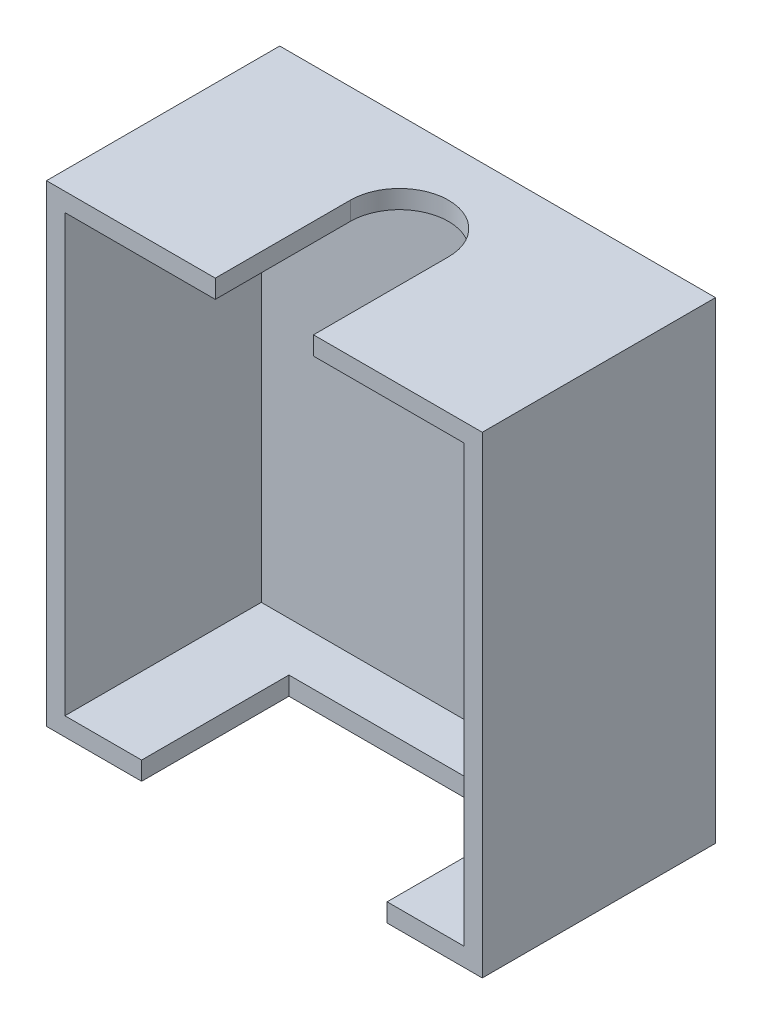
ISO-10303-21;
HEADER;
FILE_DESCRIPTION(('STEP AP214'),'2;1');
FILE_NAME('part.step','',(''),(''),'','','');
FILE_SCHEMA(('AUTOMOTIVE_DESIGN { 1 0 10303 214 1 1 1 1 }'));
ENDSEC;
DATA;
#1=APPLICATION_CONTEXT('core data for automotive mechanical design processes');
#2=APPLICATION_PROTOCOL_DEFINITION('international standard','automotive_design',2000,#1);
#3=PRODUCT_CONTEXT('',#1,'mechanical');
#4=PRODUCT('Part','Part','',(#3));
#5=PRODUCT_RELATED_PRODUCT_CATEGORY('part','',(#4));
#6=PRODUCT_DEFINITION_FORMATION('','',#4);
#7=PRODUCT_DEFINITION_CONTEXT('part definition',#1,'design');
#8=PRODUCT_DEFINITION('design','',#6,#7);
#9=PRODUCT_DEFINITION_SHAPE('','',#8);
#10=(LENGTH_UNIT() NAMED_UNIT(*) SI_UNIT(.MILLI.,.METRE.));
#11=(NAMED_UNIT(*) PLANE_ANGLE_UNIT() SI_UNIT($,.RADIAN.));
#12=(NAMED_UNIT(*) SI_UNIT($,.STERADIAN.) SOLID_ANGLE_UNIT());
#13=UNCERTAINTY_MEASURE_WITH_UNIT(LENGTH_MEASURE(1.E-05),#10,'distance_accuracy_value','');
#14=(GEOMETRIC_REPRESENTATION_CONTEXT(3) GLOBAL_UNCERTAINTY_ASSIGNED_CONTEXT((#13)) GLOBAL_UNIT_ASSIGNED_CONTEXT((#10,
#11,#12)) REPRESENTATION_CONTEXT('',''));
#15=CARTESIAN_POINT('',(0.,0.,0.));
#16=DIRECTION('',(0.,0.,1.));
#17=DIRECTION('',(1.,0.,0.));
#18=AXIS2_PLACEMENT_3D('',#15,#16,#17);
#19=CARTESIAN_POINT('',(0.,0.,19.));
#20=DIRECTION('',(0.,0.,-1.));
#21=DIRECTION('',(-1.,0.,0.));
#22=AXIS2_PLACEMENT_3D('',#19,#20,#21);
#23=PLANE('',#22);
#24=DIRECTION('',(1.,0.,0.));
#25=VECTOR('',#24,1.);
#26=CARTESIAN_POINT('',(17.75,-19.25,19.));
#27=LINE('',#26,#25);
#28=CARTESIAN_POINT('',(-17.75,-19.25,19.));
#29=VERTEX_POINT('',#28);
#30=CARTESIAN_POINT('',(-10.,-19.25,19.));
#31=VERTEX_POINT('',#30);
#32=EDGE_CURVE('E229',#29,#31,#27,.T.);
#33=ORIENTED_EDGE('',*,*,#32,.T.);
#34=DIRECTION('',(0.,-1.,0.));
#35=VECTOR('',#34,1.);
#36=CARTESIAN_POINT('',(-10.,-14.25,19.));
#37=LINE('',#36,#35);
#38=CARTESIAN_POINT('',(-10.,-17.75,19.));
#39=VERTEX_POINT('',#38);
#40=EDGE_CURVE('E158',#39,#31,#37,.T.);
#41=ORIENTED_EDGE('',*,*,#40,.F.);
#42=DIRECTION('',(1.,0.,0.));
#43=VECTOR('',#42,1.);
#44=CARTESIAN_POINT('',(16.25,-17.75,19.));
#45=LINE('',#44,#43);
#46=CARTESIAN_POINT('',(-16.25,-17.75,19.));
#47=VERTEX_POINT('',#46);
#48=EDGE_CURVE('E204',#47,#39,#45,.T.);
#49=ORIENTED_EDGE('',*,*,#48,.F.);
#50=DIRECTION('',(0.,-1.,0.));
#51=VECTOR('',#50,1.);
#52=CARTESIAN_POINT('',(-16.25,17.75,19.));
#53=LINE('',#52,#51);
#54=CARTESIAN_POINT('',(-16.25,17.75,19.));
#55=VERTEX_POINT('',#54);
#56=EDGE_CURVE('E182',#55,#47,#53,.T.);
#57=ORIENTED_EDGE('',*,*,#56,.F.);
#58=DIRECTION('',(-1.,0.,0.));
#59=VECTOR('',#58,1.);
#60=CARTESIAN_POINT('',(16.25,17.75,19.));
#61=LINE('',#60,#59);
#62=CARTESIAN_POINT('',(-4.,17.75,19.));
#63=VERTEX_POINT('',#62);
#64=EDGE_CURVE('E210',#63,#55,#61,.T.);
#65=ORIENTED_EDGE('',*,*,#64,.F.);
#66=DIRECTION('',(0.,1.,0.));
#67=VECTOR('',#66,1.);
#68=CARTESIAN_POINT('',(-4.,14.25,19.));
#69=LINE('',#68,#67);
#70=CARTESIAN_POINT('',(-4.,19.25,19.));
#71=VERTEX_POINT('',#70);
#72=EDGE_CURVE('E183',#63,#71,#69,.T.);
#73=ORIENTED_EDGE('',*,*,#72,.T.);
#74=DIRECTION('',(-1.,0.,0.));
#75=VECTOR('',#74,1.);
#76=CARTESIAN_POINT('',(17.75,19.25,19.));
#77=LINE('',#76,#75);
#78=CARTESIAN_POINT('',(-17.75,19.25,19.));
#79=VERTEX_POINT('',#78);
#80=EDGE_CURVE('E233',#71,#79,#77,.T.);
#81=ORIENTED_EDGE('',*,*,#80,.T.);
#82=DIRECTION('',(0.,-1.,0.));
#83=VECTOR('',#82,1.);
#84=CARTESIAN_POINT('',(-17.75,19.25,19.));
#85=LINE('',#84,#83);
#86=EDGE_CURVE('E224',#79,#29,#85,.T.);
#87=ORIENTED_EDGE('',*,*,#86,.T.);
#88=EDGE_LOOP('',(#33,#41,#49,#57,#65,#73,#81,#87));
#89=FACE_BOUND('',#88,.T.);
#90=ADVANCED_FACE('F32',(#89),#23,.F.);
#91=CARTESIAN_POINT('',(-17.75,19.25,19.));
#92=DIRECTION('',(1.,0.,0.));
#93=DIRECTION('',(0.,0.,-1.));
#94=AXIS2_PLACEMENT_3D('',#91,#92,#93);
#95=PLANE('',#94);
#96=DIRECTION('',(0.,-1.,0.));
#97=VECTOR('',#96,1.);
#98=CARTESIAN_POINT('',(-17.75,19.25,0.));
#99=LINE('',#98,#97);
#100=CARTESIAN_POINT('',(-17.75,19.25,0.));
#101=VERTEX_POINT('',#100);
#102=CARTESIAN_POINT('',(-17.75,-19.25,0.));
#103=VERTEX_POINT('',#102);
#104=EDGE_CURVE('E216',#101,#103,#99,.T.);
#105=ORIENTED_EDGE('',*,*,#104,.T.);
#106=DIRECTION('',(0.,0.,-1.));
#107=VECTOR('',#106,1.);
#108=CARTESIAN_POINT('',(-17.75,-19.25,19.));
#109=LINE('',#108,#107);
#110=EDGE_CURVE('E253',#29,#103,#109,.T.);
#111=ORIENTED_EDGE('',*,*,#110,.F.);
#112=ORIENTED_EDGE('',*,*,#86,.F.);
#113=DIRECTION('',(0.,0.,-1.));
#114=VECTOR('',#113,1.);
#115=CARTESIAN_POINT('',(-17.75,19.25,19.));
#116=LINE('',#115,#114);
#117=EDGE_CURVE('E237',#79,#101,#116,.T.);
#118=ORIENTED_EDGE('',*,*,#117,.T.);
#119=EDGE_LOOP('',(#105,#111,#112,#118));
#120=FACE_BOUND('',#119,.T.);
#121=ADVANCED_FACE('F34',(#120),#95,.F.);
#122=CARTESIAN_POINT('',(17.75,-19.25,19.));
#123=DIRECTION('',(0.,1.,0.));
#124=DIRECTION('',(-1.,0.,0.));
#125=AXIS2_PLACEMENT_3D('',#122,#123,#124);
#126=PLANE('',#125);
#127=DIRECTION('',(1.,0.,0.));
#128=VECTOR('',#127,1.);
#129=CARTESIAN_POINT('',(-10.,-19.25,7.));
#130=LINE('',#129,#128);
#131=CARTESIAN_POINT('',(-10.,-19.25,7.));
#132=VERTEX_POINT('',#131);
#133=CARTESIAN_POINT('',(10.,-19.25,7.));
#134=VERTEX_POINT('',#133);
#135=EDGE_CURVE('E147',#132,#134,#130,.T.);
#136=ORIENTED_EDGE('',*,*,#135,.F.);
#137=DIRECTION('',(0.,0.,-1.));
#138=VECTOR('',#137,1.);
#139=CARTESIAN_POINT('',(-10.,-19.25,19.));
#140=LINE('',#139,#138);
#141=EDGE_CURVE('E155',#31,#132,#140,.T.);
#142=ORIENTED_EDGE('',*,*,#141,.F.);
#143=ORIENTED_EDGE('',*,*,#32,.F.);
#144=ORIENTED_EDGE('',*,*,#110,.T.);
#145=DIRECTION('',(1.,0.,0.));
#146=VECTOR('',#145,1.);
#147=CARTESIAN_POINT('',(17.75,-19.25,0.));
#148=LINE('',#147,#146);
#149=CARTESIAN_POINT('',(17.75,-19.25,0.));
#150=VERTEX_POINT('',#149);
#151=EDGE_CURVE('E240',#103,#150,#148,.T.);
#152=ORIENTED_EDGE('',*,*,#151,.T.);
#153=DIRECTION('',(0.,0.,-1.));
#154=VECTOR('',#153,1.);
#155=CARTESIAN_POINT('',(17.75,-19.25,19.));
#156=LINE('',#155,#154);
#157=CARTESIAN_POINT('',(17.75,-19.25,19.));
#158=VERTEX_POINT('',#157);
#159=EDGE_CURVE('E250',#158,#150,#156,.T.);
#160=ORIENTED_EDGE('',*,*,#159,.F.);
#161=CARTESIAN_POINT('',(10.,-19.25,19.));
#162=VERTEX_POINT('',#161);
#163=EDGE_CURVE('E227',#162,#158,#27,.T.);
#164=ORIENTED_EDGE('',*,*,#163,.F.);
#165=DIRECTION('',(0.,0.,1.));
#166=VECTOR('',#165,1.);
#167=CARTESIAN_POINT('',(10.,-19.25,19.));
#168=LINE('',#167,#166);
#169=EDGE_CURVE('E152',#134,#162,#168,.T.);
#170=ORIENTED_EDGE('',*,*,#169,.F.);
#171=EDGE_LOOP('',(#136,#142,#143,#144,#152,#160,#164,#170));
#172=FACE_BOUND('',#171,.T.);
#173=ADVANCED_FACE('F162',(#172),#126,.F.);
#174=CARTESIAN_POINT('',(17.75,19.25,19.));
#175=DIRECTION('',(-1.,0.,0.));
#176=DIRECTION('',(0.,-1.,0.));
#177=AXIS2_PLACEMENT_3D('',#174,#175,#176);
#178=PLANE('',#177);
#179=DIRECTION('',(0.,1.,0.));
#180=VECTOR('',#179,1.);
#181=CARTESIAN_POINT('',(17.75,19.25,0.));
#182=LINE('',#181,#180);
#183=CARTESIAN_POINT('',(17.75,19.25,0.));
#184=VERTEX_POINT('',#183);
#185=EDGE_CURVE('E242',#150,#184,#182,.T.);
#186=ORIENTED_EDGE('',*,*,#185,.T.);
#187=DIRECTION('',(0.,0.,-1.));
#188=VECTOR('',#187,1.);
#189=CARTESIAN_POINT('',(17.75,19.25,19.));
#190=LINE('',#189,#188);
#191=CARTESIAN_POINT('',(17.75,19.25,19.));
#192=VERTEX_POINT('',#191);
#193=EDGE_CURVE('E247',#192,#184,#190,.T.);
#194=ORIENTED_EDGE('',*,*,#193,.F.);
#195=DIRECTION('',(0.,1.,0.));
#196=VECTOR('',#195,1.);
#197=CARTESIAN_POINT('',(17.75,19.25,19.));
#198=LINE('',#197,#196);
#199=EDGE_CURVE('E231',#158,#192,#198,.T.);
#200=ORIENTED_EDGE('',*,*,#199,.F.);
#201=ORIENTED_EDGE('',*,*,#159,.T.);
#202=EDGE_LOOP('',(#186,#194,#200,#201));
#203=FACE_BOUND('',#202,.T.);
#204=ADVANCED_FACE('F301',(#203),#178,.F.);
#205=CARTESIAN_POINT('',(17.75,19.25,19.));
#206=DIRECTION('',(0.,-1.,0.));
#207=DIRECTION('',(1.,0.,0.));
#208=AXIS2_PLACEMENT_3D('',#205,#206,#207);
#209=PLANE('',#208);
#210=CARTESIAN_POINT('',(0.,19.25,8.));
#211=DIRECTION('',(0.,1.,0.));
#212=DIRECTION('',(-1.,0.,0.));
#213=AXIS2_PLACEMENT_3D('',#210,#211,#212);
#214=CIRCLE('',#213,4.);
#215=CARTESIAN_POINT('',(4.,19.25,8.));
#216=VERTEX_POINT('',#215);
#217=CARTESIAN_POINT('',(-4.,19.25,8.));
#218=VERTEX_POINT('',#217);
#219=EDGE_CURVE('E175',#216,#218,#214,.T.);
#220=ORIENTED_EDGE('',*,*,#219,.F.);
#221=DIRECTION('',(0.,0.,-1.));
#222=VECTOR('',#221,1.);
#223=CARTESIAN_POINT('',(4.,19.25,0.));
#224=LINE('',#223,#222);
#225=CARTESIAN_POINT('',(4.,19.25,19.));
#226=VERTEX_POINT('',#225);
#227=EDGE_CURVE('E168',#226,#216,#224,.T.);
#228=ORIENTED_EDGE('',*,*,#227,.F.);
#229=EDGE_CURVE('E234',#192,#226,#77,.T.);
#230=ORIENTED_EDGE('',*,*,#229,.F.);
#231=ORIENTED_EDGE('',*,*,#193,.T.);
#232=DIRECTION('',(-1.,0.,0.));
#233=VECTOR('',#232,1.);
#234=CARTESIAN_POINT('',(17.75,19.25,0.));
#235=LINE('',#234,#233);
#236=EDGE_CURVE('E228',#184,#101,#235,.T.);
#237=ORIENTED_EDGE('',*,*,#236,.T.);
#238=ORIENTED_EDGE('',*,*,#117,.F.);
#239=ORIENTED_EDGE('',*,*,#80,.F.);
#240=DIRECTION('',(0.,0.,1.));
#241=VECTOR('',#240,1.);
#242=CARTESIAN_POINT('',(-4.,19.25,0.));
#243=LINE('',#242,#241);
#244=EDGE_CURVE('E177',#218,#71,#243,.T.);
#245=ORIENTED_EDGE('',*,*,#244,.F.);
#246=EDGE_LOOP('',(#220,#228,#230,#231,#237,#238,#239,#245));
#247=FACE_BOUND('',#246,.T.);
#248=ADVANCED_FACE('F306',(#247),#209,.F.);
#249=CARTESIAN_POINT('',(10.,-17.75,19.));
#250=VERTEX_POINT('',#249);
#251=CARTESIAN_POINT('',(16.25,-17.75,19.));
#252=VERTEX_POINT('',#251);
#253=EDGE_CURVE('E203',#250,#252,#45,.T.);
#254=ORIENTED_EDGE('',*,*,#253,.F.);
#255=DIRECTION('',(0.,-1.,0.));
#256=VECTOR('',#255,1.);
#257=CARTESIAN_POINT('',(10.,-14.25,19.));
#258=LINE('',#257,#256);
#259=EDGE_CURVE('E169',#250,#162,#258,.T.);
#260=ORIENTED_EDGE('',*,*,#259,.T.);
#261=ORIENTED_EDGE('',*,*,#163,.T.);
#262=ORIENTED_EDGE('',*,*,#199,.T.);
#263=ORIENTED_EDGE('',*,*,#229,.T.);
#264=DIRECTION('',(0.,1.,0.));
#265=VECTOR('',#264,1.);
#266=CARTESIAN_POINT('',(4.,14.25,19.));
#267=LINE('',#266,#265);
#268=CARTESIAN_POINT('',(4.,17.75,19.));
#269=VERTEX_POINT('',#268);
#270=EDGE_CURVE('E180',#269,#226,#267,.T.);
#271=ORIENTED_EDGE('',*,*,#270,.F.);
#272=CARTESIAN_POINT('',(16.25,17.75,19.));
#273=VERTEX_POINT('',#272);
#274=EDGE_CURVE('E192',#273,#269,#61,.T.);
#275=ORIENTED_EDGE('',*,*,#274,.F.);
#276=DIRECTION('',(0.,1.,0.));
#277=VECTOR('',#276,1.);
#278=CARTESIAN_POINT('',(16.25,17.75,19.));
#279=LINE('',#278,#277);
#280=EDGE_CURVE('E207',#252,#273,#279,.T.);
#281=ORIENTED_EDGE('',*,*,#280,.F.);
#282=EDGE_LOOP('',(#254,#260,#261,#262,#263,#271,#275,#281));
#283=FACE_BOUND('',#282,.T.);
#284=ADVANCED_FACE('F272',(#283),#23,.F.);
#285=CARTESIAN_POINT('',(0.,0.,0.));
#286=DIRECTION('',(0.,0.,-1.));
#287=DIRECTION('',(-1.,0.,0.));
#288=AXIS2_PLACEMENT_3D('',#285,#286,#287);
#289=PLANE('',#288);
#290=ORIENTED_EDGE('',*,*,#104,.F.);
#291=ORIENTED_EDGE('',*,*,#236,.F.);
#292=ORIENTED_EDGE('',*,*,#185,.F.);
#293=ORIENTED_EDGE('',*,*,#151,.F.);
#294=EDGE_LOOP('',(#290,#291,#292,#293));
#295=FACE_BOUND('',#294,.T.);
#296=ADVANCED_FACE('F297',(#295),#289,.T.);
#297=CARTESIAN_POINT('',(-16.25,17.75,3.));
#298=DIRECTION('',(-1.,0.,0.));
#299=DIRECTION('',(0.,-1.,0.));
#300=AXIS2_PLACEMENT_3D('',#297,#298,#299);
#301=PLANE('',#300);
#302=ORIENTED_EDGE('',*,*,#56,.T.);
#303=DIRECTION('',(0.,0.,1.));
#304=VECTOR('',#303,1.);
#305=CARTESIAN_POINT('',(-16.25,-17.75,3.));
#306=LINE('',#305,#304);
#307=CARTESIAN_POINT('',(-16.25,-17.75,3.));
#308=VERTEX_POINT('',#307);
#309=EDGE_CURVE('E201',#308,#47,#306,.T.);
#310=ORIENTED_EDGE('',*,*,#309,.F.);
#311=DIRECTION('',(0.,-1.,0.));
#312=VECTOR('',#311,1.);
#313=CARTESIAN_POINT('',(-16.25,17.75,3.));
#314=LINE('',#313,#312);
#315=CARTESIAN_POINT('',(-16.25,17.75,3.));
#316=VERTEX_POINT('',#315);
#317=EDGE_CURVE('E188',#316,#308,#314,.T.);
#318=ORIENTED_EDGE('',*,*,#317,.F.);
#319=DIRECTION('',(0.,0.,1.));
#320=VECTOR('',#319,1.);
#321=CARTESIAN_POINT('',(-16.25,17.75,3.));
#322=LINE('',#321,#320);
#323=EDGE_CURVE('E213',#316,#55,#322,.T.);
#324=ORIENTED_EDGE('',*,*,#323,.T.);
#325=EDGE_LOOP('',(#302,#310,#318,#324));
#326=FACE_BOUND('',#325,.T.);
#327=ADVANCED_FACE('F285',(#326),#301,.F.);
#328=CARTESIAN_POINT('',(16.25,17.75,3.));
#329=DIRECTION('',(0.,1.,0.));
#330=DIRECTION('',(-1.,0.,0.));
#331=AXIS2_PLACEMENT_3D('',#328,#329,#330);
#332=PLANE('',#331);
#333=ORIENTED_EDGE('',*,*,#274,.T.);
#334=DIRECTION('',(0.,0.,-1.));
#335=VECTOR('',#334,1.);
#336=CARTESIAN_POINT('',(4.,17.75,3.));
#337=LINE('',#336,#335);
#338=CARTESIAN_POINT('',(4.,17.75,8.));
#339=VERTEX_POINT('',#338);
#340=EDGE_CURVE('E262',#269,#339,#337,.T.);
#341=ORIENTED_EDGE('',*,*,#340,.T.);
#342=CARTESIAN_POINT('',(0.,17.75,8.));
#343=DIRECTION('',(0.,1.,0.));
#344=DIRECTION('',(-1.,0.,0.));
#345=AXIS2_PLACEMENT_3D('',#342,#343,#344);
#346=CIRCLE('',#345,4.);
#347=CARTESIAN_POINT('',(-4.,17.75,8.));
#348=VERTEX_POINT('',#347);
#349=EDGE_CURVE('E256',#339,#348,#346,.T.);
#350=ORIENTED_EDGE('',*,*,#349,.T.);
#351=DIRECTION('',(0.,0.,1.));
#352=VECTOR('',#351,1.);
#353=CARTESIAN_POINT('',(-4.,17.75,3.));
#354=LINE('',#353,#352);
#355=EDGE_CURVE('E259',#348,#63,#354,.T.);
#356=ORIENTED_EDGE('',*,*,#355,.T.);
#357=ORIENTED_EDGE('',*,*,#64,.T.);
#358=ORIENTED_EDGE('',*,*,#323,.F.);
#359=DIRECTION('',(-1.,0.,0.));
#360=VECTOR('',#359,1.);
#361=CARTESIAN_POINT('',(16.25,17.75,3.));
#362=LINE('',#361,#360);
#363=CARTESIAN_POINT('',(16.25,17.75,3.));
#364=VERTEX_POINT('',#363);
#365=EDGE_CURVE('E198',#364,#316,#362,.T.);
#366=ORIENTED_EDGE('',*,*,#365,.F.);
#367=DIRECTION('',(0.,0.,1.));
#368=VECTOR('',#367,1.);
#369=CARTESIAN_POINT('',(16.25,17.75,3.));
#370=LINE('',#369,#368);
#371=EDGE_CURVE('E217',#364,#273,#370,.T.);
#372=ORIENTED_EDGE('',*,*,#371,.T.);
#373=EDGE_LOOP('',(#333,#341,#350,#356,#357,#358,#366,#372));
#374=FACE_BOUND('',#373,.T.);
#375=ADVANCED_FACE('F310',(#374),#332,.F.);
#376=CARTESIAN_POINT('',(16.25,17.75,3.));
#377=DIRECTION('',(1.,0.,0.));
#378=DIRECTION('',(0.,1.,0.));
#379=AXIS2_PLACEMENT_3D('',#376,#377,#378);
#380=PLANE('',#379);
#381=ORIENTED_EDGE('',*,*,#280,.T.);
#382=ORIENTED_EDGE('',*,*,#371,.F.);
#383=DIRECTION('',(0.,1.,0.));
#384=VECTOR('',#383,1.);
#385=CARTESIAN_POINT('',(16.25,17.75,3.));
#386=LINE('',#385,#384);
#387=CARTESIAN_POINT('',(16.25,-17.75,3.));
#388=VERTEX_POINT('',#387);
#389=EDGE_CURVE('E195',#388,#364,#386,.T.);
#390=ORIENTED_EDGE('',*,*,#389,.F.);
#391=DIRECTION('',(0.,0.,1.));
#392=VECTOR('',#391,1.);
#393=CARTESIAN_POINT('',(16.25,-17.75,3.));
#394=LINE('',#393,#392);
#395=EDGE_CURVE('E219',#388,#252,#394,.T.);
#396=ORIENTED_EDGE('',*,*,#395,.T.);
#397=EDGE_LOOP('',(#381,#382,#390,#396));
#398=FACE_BOUND('',#397,.T.);
#399=ADVANCED_FACE('F276',(#398),#380,.F.);
#400=CARTESIAN_POINT('',(16.25,-17.75,3.));
#401=DIRECTION('',(0.,-1.,0.));
#402=DIRECTION('',(0.,0.,-1.));
#403=AXIS2_PLACEMENT_3D('',#400,#401,#402);
#404=PLANE('',#403);
#405=ORIENTED_EDGE('',*,*,#48,.T.);
#406=DIRECTION('',(0.,0.,-1.));
#407=VECTOR('',#406,1.);
#408=CARTESIAN_POINT('',(-9.99999999999999,-17.75,2.99999999999999));
#409=LINE('',#408,#407);
#410=CARTESIAN_POINT('',(-10.,-17.75,7.));
#411=VERTEX_POINT('',#410);
#412=EDGE_CURVE('E11',#39,#411,#409,.T.);
#413=ORIENTED_EDGE('',*,*,#412,.T.);
#414=DIRECTION('',(1.,0.,0.));
#415=VECTOR('',#414,1.);
#416=CARTESIAN_POINT('',(16.25,-17.75,7.));
#417=LINE('',#416,#415);
#418=CARTESIAN_POINT('',(10.,-17.75,7.));
#419=VERTEX_POINT('',#418);
#420=EDGE_CURVE('E150',#411,#419,#417,.T.);
#421=ORIENTED_EDGE('',*,*,#420,.T.);
#422=DIRECTION('',(0.,0.,1.));
#423=VECTOR('',#422,1.);
#424=CARTESIAN_POINT('',(10.,-17.75,3.));
#425=LINE('',#424,#423);
#426=EDGE_CURVE('E40',#419,#250,#425,.T.);
#427=ORIENTED_EDGE('',*,*,#426,.T.);
#428=ORIENTED_EDGE('',*,*,#253,.T.);
#429=ORIENTED_EDGE('',*,*,#395,.F.);
#430=DIRECTION('',(1.,0.,0.));
#431=VECTOR('',#430,1.);
#432=CARTESIAN_POINT('',(16.25,-17.75,3.));
#433=LINE('',#432,#431);
#434=EDGE_CURVE('E191',#308,#388,#433,.T.);
#435=ORIENTED_EDGE('',*,*,#434,.F.);
#436=ORIENTED_EDGE('',*,*,#309,.T.);
#437=EDGE_LOOP('',(#405,#413,#421,#427,#428,#429,#435,#436));
#438=FACE_BOUND('',#437,.T.);
#439=ADVANCED_FACE('F268',(#438),#404,.F.);
#440=CARTESIAN_POINT('',(0.,0.,3.));
#441=DIRECTION('',(0.,0.,-1.));
#442=DIRECTION('',(-1.,0.,0.));
#443=AXIS2_PLACEMENT_3D('',#440,#441,#442);
#444=PLANE('',#443);
#445=ORIENTED_EDGE('',*,*,#317,.T.);
#446=ORIENTED_EDGE('',*,*,#434,.T.);
#447=ORIENTED_EDGE('',*,*,#389,.T.);
#448=ORIENTED_EDGE('',*,*,#365,.T.);
#449=EDGE_LOOP('',(#445,#446,#447,#448));
#450=FACE_BOUND('',#449,.T.);
#451=ADVANCED_FACE('F282',(#450),#444,.F.);
#452=CARTESIAN_POINT('',(4.,14.25,0.));
#453=DIRECTION('',(1.,0.,0.));
#454=DIRECTION('',(0.,1.,0.));
#455=AXIS2_PLACEMENT_3D('',#452,#453,#454);
#456=PLANE('',#455);
#457=ORIENTED_EDGE('',*,*,#270,.T.);
#458=ORIENTED_EDGE('',*,*,#227,.T.);
#459=DIRECTION('',(0.,1.,0.));
#460=VECTOR('',#459,1.);
#461=CARTESIAN_POINT('',(4.,14.25,8.));
#462=LINE('',#461,#460);
#463=EDGE_CURVE('E179',#339,#216,#462,.T.);
#464=ORIENTED_EDGE('',*,*,#463,.F.);
#465=ORIENTED_EDGE('',*,*,#340,.F.);
#466=EDGE_LOOP('',(#457,#458,#464,#465));
#467=FACE_BOUND('',#466,.T.);
#468=ADVANCED_FACE('F317',(#467),#456,.F.);
#469=CARTESIAN_POINT('',(-4.,14.25,0.));
#470=DIRECTION('',(-1.,0.,0.));
#471=DIRECTION('',(0.,0.,1.));
#472=AXIS2_PLACEMENT_3D('',#469,#470,#471);
#473=PLANE('',#472);
#474=DIRECTION('',(0.,1.,0.));
#475=VECTOR('',#474,1.);
#476=CARTESIAN_POINT('',(-4.,14.25,8.));
#477=LINE('',#476,#475);
#478=EDGE_CURVE('E55',#348,#218,#477,.T.);
#479=ORIENTED_EDGE('',*,*,#478,.T.);
#480=ORIENTED_EDGE('',*,*,#244,.T.);
#481=ORIENTED_EDGE('',*,*,#72,.F.);
#482=ORIENTED_EDGE('',*,*,#355,.F.);
#483=EDGE_LOOP('',(#479,#480,#481,#482));
#484=FACE_BOUND('',#483,.T.);
#485=ADVANCED_FACE('F312',(#484),#473,.F.);
#486=CARTESIAN_POINT('',(0.,14.25,8.));
#487=DIRECTION('',(0.,1.,0.));
#488=DIRECTION('',(-1.,0.,0.));
#489=AXIS2_PLACEMENT_3D('',#486,#487,#488);
#490=CYLINDRICAL_SURFACE('',#489,4.);
#491=ORIENTED_EDGE('',*,*,#463,.T.);
#492=ORIENTED_EDGE('',*,*,#219,.T.);
#493=ORIENTED_EDGE('',*,*,#478,.F.);
#494=ORIENTED_EDGE('',*,*,#349,.F.);
#495=EDGE_LOOP('',(#491,#492,#493,#494));
#496=FACE_BOUND('',#495,.T.);
#497=ADVANCED_FACE('F315',(#496),#490,.F.);
#498=CARTESIAN_POINT('',(-10.,-14.25,19.));
#499=DIRECTION('',(-1.,0.,0.));
#500=DIRECTION('',(0.,0.,1.));
#501=AXIS2_PLACEMENT_3D('',#498,#499,#500);
#502=PLANE('',#501);
#503=ORIENTED_EDGE('',*,*,#40,.T.);
#504=ORIENTED_EDGE('',*,*,#141,.T.);
#505=DIRECTION('',(0.,-1.,0.));
#506=VECTOR('',#505,1.);
#507=CARTESIAN_POINT('',(-10.,-14.25,7.));
#508=LINE('',#507,#506);
#509=EDGE_CURVE('E143',#411,#132,#508,.T.);
#510=ORIENTED_EDGE('',*,*,#509,.F.);
#511=ORIENTED_EDGE('',*,*,#412,.F.);
#512=EDGE_LOOP('',(#503,#504,#510,#511));
#513=FACE_BOUND('',#512,.T.);
#514=ADVANCED_FACE('F156',(#513),#502,.F.);
#515=CARTESIAN_POINT('',(10.,-14.25,19.));
#516=DIRECTION('',(1.,0.,0.));
#517=DIRECTION('',(0.,1.,0.));
#518=AXIS2_PLACEMENT_3D('',#515,#516,#517);
#519=PLANE('',#518);
#520=DIRECTION('',(0.,-1.,0.));
#521=VECTOR('',#520,1.);
#522=CARTESIAN_POINT('',(10.,-14.25,7.));
#523=LINE('',#522,#521);
#524=EDGE_CURVE('E47',#419,#134,#523,.T.);
#525=ORIENTED_EDGE('',*,*,#524,.T.);
#526=ORIENTED_EDGE('',*,*,#169,.T.);
#527=ORIENTED_EDGE('',*,*,#259,.F.);
#528=ORIENTED_EDGE('',*,*,#426,.F.);
#529=EDGE_LOOP('',(#525,#526,#527,#528));
#530=FACE_BOUND('',#529,.T.);
#531=ADVANCED_FACE('F428',(#530),#519,.F.);
#532=CARTESIAN_POINT('',(-10.,-14.25,7.));
#533=DIRECTION('',(0.,0.,-1.));
#534=DIRECTION('',(-1.,0.,0.));
#535=AXIS2_PLACEMENT_3D('',#532,#533,#534);
#536=PLANE('',#535);
#537=ORIENTED_EDGE('',*,*,#509,.T.);
#538=ORIENTED_EDGE('',*,*,#135,.T.);
#539=ORIENTED_EDGE('',*,*,#524,.F.);
#540=ORIENTED_EDGE('',*,*,#420,.F.);
#541=EDGE_LOOP('',(#537,#538,#539,#540));
#542=FACE_BOUND('',#541,.T.);
#543=ADVANCED_FACE('F145',(#542),#536,.F.);
#544=CLOSED_SHELL('',(#90,#121,#173,#204,#248,#284,#296,#327,#375,#399,#439,#451,#468,#485,#497,
#514,#531,#543));
#545=MANIFOLD_SOLID_BREP('B2',#544);
#546=ADVANCED_BREP_SHAPE_REPRESENTATION('',(#18,#545),#14);
#547=SHAPE_DEFINITION_REPRESENTATION(#9,#546);
ENDSEC;
END-ISO-10303-21;
